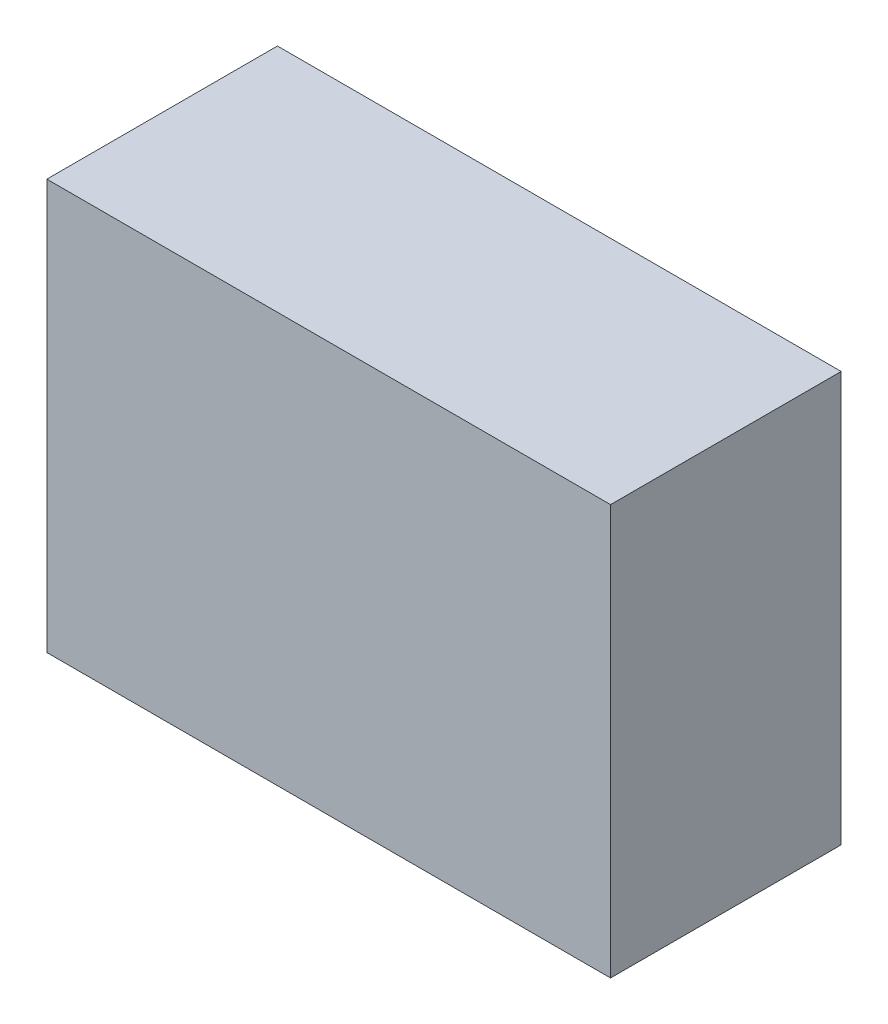
ISO-10303-21;
HEADER;
FILE_DESCRIPTION(('STEP AP214'),'2;1');
FILE_NAME('part.step','',(''),(''),'','','');
FILE_SCHEMA(('AUTOMOTIVE_DESIGN { 1 0 10303 214 1 1 1 1 }'));
ENDSEC;
DATA;
#1=APPLICATION_CONTEXT('core data for automotive mechanical design processes');
#2=APPLICATION_PROTOCOL_DEFINITION('international standard','automotive_design',2000,#1);
#3=PRODUCT_CONTEXT('',#1,'mechanical');
#4=PRODUCT('Part','Part','',(#3));
#5=PRODUCT_RELATED_PRODUCT_CATEGORY('part','',(#4));
#6=PRODUCT_DEFINITION_FORMATION('','',#4);
#7=PRODUCT_DEFINITION_CONTEXT('part definition',#1,'design');
#8=PRODUCT_DEFINITION('design','',#6,#7);
#9=PRODUCT_DEFINITION_SHAPE('','',#8);
#10=(LENGTH_UNIT() NAMED_UNIT(*) SI_UNIT(.MILLI.,.METRE.));
#11=(NAMED_UNIT(*) PLANE_ANGLE_UNIT() SI_UNIT($,.RADIAN.));
#12=(NAMED_UNIT(*) SI_UNIT($,.STERADIAN.) SOLID_ANGLE_UNIT());
#13=UNCERTAINTY_MEASURE_WITH_UNIT(LENGTH_MEASURE(1.E-05),#10,'distance_accuracy_value','');
#14=(GEOMETRIC_REPRESENTATION_CONTEXT(3) GLOBAL_UNCERTAINTY_ASSIGNED_CONTEXT((#13)) GLOBAL_UNIT_ASSIGNED_CONTEXT((#10,
#11,#12)) REPRESENTATION_CONTEXT('',''));
#15=CARTESIAN_POINT('',(0.,0.,0.));
#16=DIRECTION('',(0.,0.,1.));
#17=DIRECTION('',(1.,0.,0.));
#18=AXIS2_PLACEMENT_3D('',#15,#16,#17);
#19=CARTESIAN_POINT('',(1.10000034,0.80000094,0.90000074));
#20=DIRECTION('',(0.,0.,-1.));
#21=DIRECTION('',(-1.,0.,0.));
#22=AXIS2_PLACEMENT_3D('',#19,#20,#21);
#23=PLANE('',#22);
#24=DIRECTION('',(0.,1.,0.));
#25=VECTOR('',#24,1.);
#26=CARTESIAN_POINT('',(-1.10000034,0.80000094,0.90000074));
#27=LINE('',#26,#25);
#28=CARTESIAN_POINT('',(-1.10000034,0.80000094,0.90000074));
#29=VERTEX_POINT('',#28);
#30=CARTESIAN_POINT('',(-1.10000034,-0.80000094,0.90000074));
#31=VERTEX_POINT('',#30);
#32=EDGE_CURVE('E55',#29,#31,#27,.F.);
#33=ORIENTED_EDGE('',*,*,#32,.T.);
#34=DIRECTION('',(1.,0.,0.));
#35=VECTOR('',#34,1.);
#36=CARTESIAN_POINT('',(-1.10000034,-0.80000094,0.90000074));
#37=LINE('',#36,#35);
#38=CARTESIAN_POINT('',(1.10000034,-0.80000094,0.90000074));
#39=VERTEX_POINT('',#38);
#40=EDGE_CURVE('E57',#31,#39,#37,.T.);
#41=ORIENTED_EDGE('',*,*,#40,.T.);
#42=DIRECTION('',(0.,1.,0.));
#43=VECTOR('',#42,1.);
#44=CARTESIAN_POINT('',(1.10000034,-0.80000094,0.90000074));
#45=LINE('',#44,#43);
#46=CARTESIAN_POINT('',(1.10000034,0.80000094,0.90000074));
#47=VERTEX_POINT('',#46);
#48=EDGE_CURVE('E20',#39,#47,#45,.T.);
#49=ORIENTED_EDGE('',*,*,#48,.T.);
#50=DIRECTION('',(1.,0.,0.));
#51=VECTOR('',#50,1.);
#52=CARTESIAN_POINT('',(1.10000034,0.80000094,0.90000074));
#53=LINE('',#52,#51);
#54=EDGE_CURVE('E80',#47,#29,#53,.F.);
#55=ORIENTED_EDGE('',*,*,#54,.T.);
#56=EDGE_LOOP('',(#33,#41,#49,#55));
#57=FACE_BOUND('',#56,.T.);
#58=ADVANCED_FACE('F17',(#57),#23,.F.);
#59=CARTESIAN_POINT('',(1.10000034,-0.80000094,0.));
#60=DIRECTION('',(-1.,0.,0.));
#61=DIRECTION('',(0.,0.,1.));
#62=AXIS2_PLACEMENT_3D('',#59,#60,#61);
#63=PLANE('',#62);
#64=DIRECTION('',(0.,0.,-1.));
#65=VECTOR('',#64,1.);
#66=CARTESIAN_POINT('',(1.10000034,0.80000094,0.));
#67=LINE('',#66,#65);
#68=CARTESIAN_POINT('',(1.10000034,0.80000094,0.));
#69=VERTEX_POINT('',#68);
#70=EDGE_CURVE('E68',#69,#47,#67,.F.);
#71=ORIENTED_EDGE('',*,*,#70,.T.);
#72=ORIENTED_EDGE('',*,*,#48,.F.);
#73=DIRECTION('',(0.,0.,1.));
#74=VECTOR('',#73,1.);
#75=CARTESIAN_POINT('',(1.10000034,-0.80000094,0.));
#76=LINE('',#75,#74);
#77=CARTESIAN_POINT('',(1.10000034,-0.80000094,0.));
#78=VERTEX_POINT('',#77);
#79=EDGE_CURVE('E63',#39,#78,#76,.F.);
#80=ORIENTED_EDGE('',*,*,#79,.T.);
#81=DIRECTION('',(0.,1.,0.));
#82=VECTOR('',#81,1.);
#83=CARTESIAN_POINT('',(1.10000034,0.80000094,0.));
#84=LINE('',#83,#82);
#85=EDGE_CURVE('E83',#69,#78,#84,.F.);
#86=ORIENTED_EDGE('',*,*,#85,.F.);
#87=EDGE_LOOP('',(#71,#72,#80,#86));
#88=FACE_BOUND('',#87,.T.);
#89=ADVANCED_FACE('F65',(#88),#63,.F.);
#90=CARTESIAN_POINT('',(-1.10000034,-0.80000094,0.));
#91=DIRECTION('',(0.,1.,0.));
#92=DIRECTION('',(0.,0.,1.));
#93=AXIS2_PLACEMENT_3D('',#90,#91,#92);
#94=PLANE('',#93);
#95=ORIENTED_EDGE('',*,*,#79,.F.);
#96=ORIENTED_EDGE('',*,*,#40,.F.);
#97=DIRECTION('',(0.,0.,-1.));
#98=VECTOR('',#97,1.);
#99=CARTESIAN_POINT('',(-1.10000034,-0.80000094,0.));
#100=LINE('',#99,#98);
#101=CARTESIAN_POINT('',(-1.10000034,-0.80000094,0.));
#102=VERTEX_POINT('',#101);
#103=EDGE_CURVE('E75',#31,#102,#100,.T.);
#104=ORIENTED_EDGE('',*,*,#103,.T.);
#105=DIRECTION('',(-1.,0.,0.));
#106=VECTOR('',#105,1.);
#107=CARTESIAN_POINT('',(1.10000034,-0.80000094,0.));
#108=LINE('',#107,#106);
#109=EDGE_CURVE('E72',#78,#102,#108,.T.);
#110=ORIENTED_EDGE('',*,*,#109,.F.);
#111=EDGE_LOOP('',(#95,#96,#104,#110));
#112=FACE_BOUND('',#111,.T.);
#113=ADVANCED_FACE('F70',(#112),#94,.F.);
#114=CARTESIAN_POINT('',(-1.10000034,0.80000094,0.));
#115=DIRECTION('',(1.,0.,0.));
#116=DIRECTION('',(0.,0.,-1.));
#117=AXIS2_PLACEMENT_3D('',#114,#115,#116);
#118=PLANE('',#117);
#119=ORIENTED_EDGE('',*,*,#103,.F.);
#120=ORIENTED_EDGE('',*,*,#32,.F.);
#121=DIRECTION('',(0.,0.,-1.));
#122=VECTOR('',#121,1.);
#123=CARTESIAN_POINT('',(-1.10000034,0.80000094,0.));
#124=LINE('',#123,#122);
#125=CARTESIAN_POINT('',(-1.10000034,0.80000094,0.));
#126=VERTEX_POINT('',#125);
#127=EDGE_CURVE('E35',#29,#126,#124,.T.);
#128=ORIENTED_EDGE('',*,*,#127,.T.);
#129=DIRECTION('',(0.,1.,0.));
#130=VECTOR('',#129,1.);
#131=CARTESIAN_POINT('',(-1.10000034,0.80000094,0.));
#132=LINE('',#131,#130);
#133=EDGE_CURVE('E26',#102,#126,#132,.T.);
#134=ORIENTED_EDGE('',*,*,#133,.F.);
#135=EDGE_LOOP('',(#119,#120,#128,#134));
#136=FACE_BOUND('',#135,.T.);
#137=ADVANCED_FACE('F89',(#136),#118,.F.);
#138=CARTESIAN_POINT('',(1.10000034,0.80000094,0.));
#139=DIRECTION('',(0.,-1.,0.));
#140=DIRECTION('',(0.,0.,-1.));
#141=AXIS2_PLACEMENT_3D('',#138,#139,#140);
#142=PLANE('',#141);
#143=ORIENTED_EDGE('',*,*,#127,.F.);
#144=ORIENTED_EDGE('',*,*,#54,.F.);
#145=ORIENTED_EDGE('',*,*,#70,.F.);
#146=DIRECTION('',(-1.,0.,0.));
#147=VECTOR('',#146,1.);
#148=CARTESIAN_POINT('',(1.10000034,0.80000094,0.));
#149=LINE('',#148,#147);
#150=EDGE_CURVE('E11',#126,#69,#149,.F.);
#151=ORIENTED_EDGE('',*,*,#150,.F.);
#152=EDGE_LOOP('',(#143,#144,#145,#151));
#153=FACE_BOUND('',#152,.T.);
#154=ADVANCED_FACE('F91',(#153),#142,.F.);
#155=CARTESIAN_POINT('',(1.10000034,0.80000094,0.));
#156=DIRECTION('',(0.,0.,-1.));
#157=DIRECTION('',(-1.,0.,0.));
#158=AXIS2_PLACEMENT_3D('',#155,#156,#157);
#159=PLANE('',#158);
#160=ORIENTED_EDGE('',*,*,#133,.T.);
#161=ORIENTED_EDGE('',*,*,#150,.T.);
#162=ORIENTED_EDGE('',*,*,#85,.T.);
#163=ORIENTED_EDGE('',*,*,#109,.T.);
#164=EDGE_LOOP('',(#160,#161,#162,#163));
#165=FACE_BOUND('',#164,.T.);
#166=ADVANCED_FACE('F88',(#165),#159,.T.);
#167=CLOSED_SHELL('',(#58,#89,#113,#137,#154,#166));
#168=MANIFOLD_SOLID_BREP('B1',#167);
#169=ADVANCED_BREP_SHAPE_REPRESENTATION('',(#18,#168),#14);
#170=SHAPE_DEFINITION_REPRESENTATION(#9,#169);
ENDSEC;
END-ISO-10303-21;
